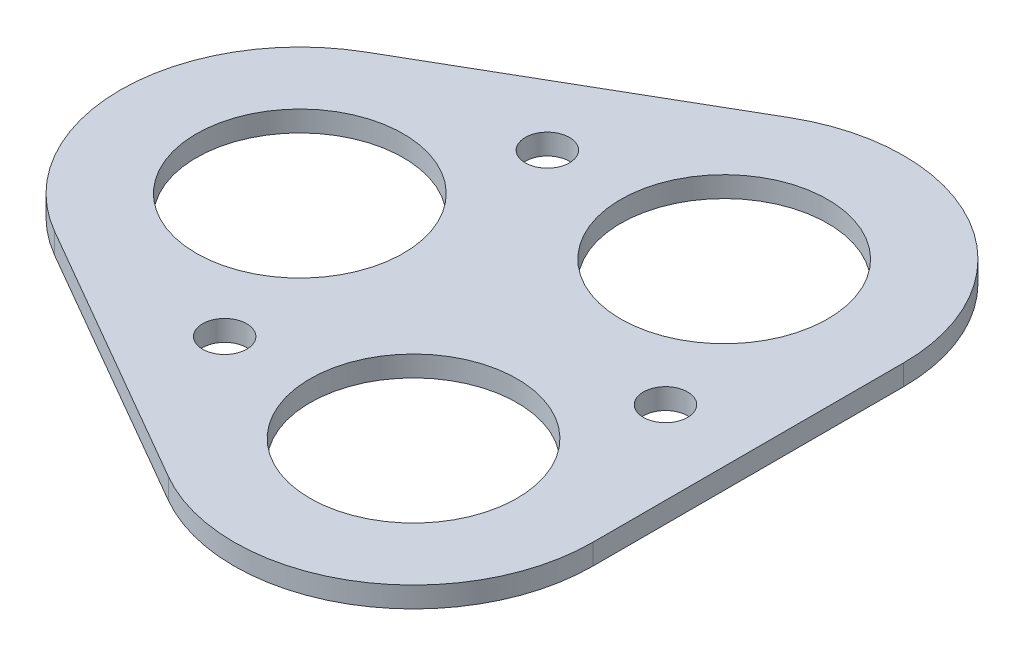
ISO-10303-21;
HEADER;
FILE_DESCRIPTION(('STEP AP214'),'2;1');
FILE_NAME('part.step','',(''),(''),'','','');
FILE_SCHEMA(('AUTOMOTIVE_DESIGN { 1 0 10303 214 1 1 1 1 }'));
ENDSEC;
DATA;
#1=APPLICATION_CONTEXT('core data for automotive mechanical design processes');
#2=APPLICATION_PROTOCOL_DEFINITION('international standard','automotive_design',2000,#1);
#3=PRODUCT_CONTEXT('',#1,'mechanical');
#4=PRODUCT('Part','Part','',(#3));
#5=PRODUCT_RELATED_PRODUCT_CATEGORY('part','',(#4));
#6=PRODUCT_DEFINITION_FORMATION('','',#4);
#7=PRODUCT_DEFINITION_CONTEXT('part definition',#1,'design');
#8=PRODUCT_DEFINITION('design','',#6,#7);
#9=PRODUCT_DEFINITION_SHAPE('','',#8);
#10=(LENGTH_UNIT() NAMED_UNIT(*) SI_UNIT(.MILLI.,.METRE.));
#11=(NAMED_UNIT(*) PLANE_ANGLE_UNIT() SI_UNIT($,.RADIAN.));
#12=(NAMED_UNIT(*) SI_UNIT($,.STERADIAN.) SOLID_ANGLE_UNIT());
#13=UNCERTAINTY_MEASURE_WITH_UNIT(LENGTH_MEASURE(1.E-05),#10,'distance_accuracy_value','');
#14=(GEOMETRIC_REPRESENTATION_CONTEXT(3) GLOBAL_UNCERTAINTY_ASSIGNED_CONTEXT((#13)) GLOBAL_UNIT_ASSIGNED_CONTEXT((#10,
#11,#12)) REPRESENTATION_CONTEXT('',''));
#15=CARTESIAN_POINT('',(0.,0.,0.));
#16=DIRECTION('',(0.,0.,1.));
#17=DIRECTION('',(1.,0.,0.));
#18=AXIS2_PLACEMENT_3D('',#15,#16,#17);
#19=CARTESIAN_POINT('',(-9.30432632419985,1.5,0.));
#20=DIRECTION('',(0.,1.,0.));
#21=DIRECTION('',(0.,0.,1.));
#22=AXIS2_PLACEMENT_3D('',#19,#20,#21);
#23=PLANE('',#22);
#24=CARTESIAN_POINT('',(17.1812452635102,1.5,0.));
#25=DIRECTION('',(0.,1.,0.));
#26=DIRECTION('',(0.,0.,1.));
#27=AXIS2_PLACEMENT_3D('',#24,#25,#26);
#28=CIRCLE('',#27,1.59999999755117);
#29=CARTESIAN_POINT('',(17.1812452635102,1.5,1.59999999755114));
#30=VERTEX_POINT('',#29);
#31=EDGE_CURVE('E204',#30,#30,#28,.T.);
#32=ORIENTED_EDGE('',*,*,#31,.F.);
#33=EDGE_LOOP('',(#32));
#34=FACE_BOUND('',#33,.T.);
#35=CARTESIAN_POINT('',(10.18124526095,1.5,11.25));
#36=DIRECTION('',(0.,1.,0.));
#37=DIRECTION('',(0.,0.,1.));
#38=AXIS2_PLACEMENT_3D('',#35,#36,#37);
#39=CIRCLE('',#38,7.50000000000001);
#40=CARTESIAN_POINT('',(10.18124526095,1.5,18.75));
#41=VERTEX_POINT('',#40);
#42=EDGE_CURVE('E216',#41,#41,#39,.T.);
#43=ORIENTED_EDGE('',*,*,#42,.F.);
#44=EDGE_LOOP('',(#43));
#45=FACE_BOUND('',#44,.T.);
#46=CARTESIAN_POINT('',(-9.30432632419985,1.5,0.));
#47=DIRECTION('',(0.,1.,0.));
#48=DIRECTION('',(0.,0.,1.));
#49=AXIS2_PLACEMENT_3D('',#46,#47,#48);
#50=CIRCLE('',#49,7.50000000000003);
#51=CARTESIAN_POINT('',(-9.30432632419985,1.5,7.50000000000009));
#52=VERTEX_POINT('',#51);
#53=EDGE_CURVE('E129',#52,#52,#50,.T.);
#54=ORIENTED_EDGE('',*,*,#53,.F.);
#55=EDGE_LOOP('',(#54));
#56=FACE_BOUND('',#55,.T.);
#57=CARTESIAN_POINT('',(-9.30432632419985,1.5,0.));
#58=DIRECTION('',(0.,1.,0.));
#59=DIRECTION('',(0.,0.,1.));
#60=AXIS2_PLACEMENT_3D('',#57,#58,#59);
#61=CIRCLE('',#60,13.);
#62=CARTESIAN_POINT('',(-15.8043263241999,1.5,-11.2583302491977));
#63=VERTEX_POINT('',#62);
#64=CARTESIAN_POINT('',(-15.8043263241998,1.5,11.2583302491978));
#65=VERTEX_POINT('',#64);
#66=EDGE_CURVE('E136',#63,#65,#61,.T.);
#67=ORIENTED_EDGE('',*,*,#66,.T.);
#68=DIRECTION('',(0.86602540378444,0.,0.499999999999997));
#69=VECTOR('',#68,1.);
#70=CARTESIAN_POINT('',(-15.8043263241998,1.5,11.2583302491978));
#71=LINE('',#70,#69);
#72=CARTESIAN_POINT('',(3.68124526095003,1.5,22.5083302491977));
#73=VERTEX_POINT('',#72);
#74=EDGE_CURVE('E94',#65,#73,#71,.T.);
#75=ORIENTED_EDGE('',*,*,#74,.T.);
#76=CARTESIAN_POINT('',(10.18124526095,1.5,11.25));
#77=DIRECTION('',(0.,1.,0.));
#78=DIRECTION('',(0.,0.,1.));
#79=AXIS2_PLACEMENT_3D('',#76,#77,#78);
#80=CIRCLE('',#79,13.);
#81=CARTESIAN_POINT('',(23.1812452609501,1.5,11.2499999999999));
#82=VERTEX_POINT('',#81);
#83=EDGE_CURVE('E107',#73,#82,#80,.T.);
#84=ORIENTED_EDGE('',*,*,#83,.T.);
#85=DIRECTION('',(0.,0.,-1.));
#86=VECTOR('',#85,1.);
#87=CARTESIAN_POINT('',(23.1812452609501,1.5,11.2499999999999));
#88=LINE('',#87,#86);
#89=CARTESIAN_POINT('',(23.18124526095,1.5,-11.25));
#90=VERTEX_POINT('',#89);
#91=EDGE_CURVE('E101',#82,#90,#88,.T.);
#92=ORIENTED_EDGE('',*,*,#91,.T.);
#93=CARTESIAN_POINT('',(10.18124526095,1.5,-11.25));
#94=DIRECTION('',(0.,1.,0.));
#95=DIRECTION('',(0.,0.,1.));
#96=AXIS2_PLACEMENT_3D('',#93,#94,#95);
#97=CIRCLE('',#96,13.);
#98=CARTESIAN_POINT('',(3.6812452609499,1.5,-22.5083302491977));
#99=VERTEX_POINT('',#98);
#100=EDGE_CURVE('E105',#90,#99,#97,.T.);
#101=ORIENTED_EDGE('',*,*,#100,.T.);
#102=DIRECTION('',(-0.866025403784437,0.,0.500000000000003));
#103=VECTOR('',#102,1.);
#104=CARTESIAN_POINT('',(3.6812452609499,1.5,-22.5083302491977));
#105=LINE('',#104,#103);
#106=EDGE_CURVE('E57',#99,#63,#105,.T.);
#107=ORIENTED_EDGE('',*,*,#106,.T.);
#108=EDGE_LOOP('',(#67,#75,#84,#92,#101,#107));
#109=FACE_BOUND('',#108,.T.);
#110=CARTESIAN_POINT('',(-3.06154026999395,1.5,-11.6871778582266));
#111=DIRECTION('',(0.,1.,0.));
#112=DIRECTION('',(0.,0.,1.));
#113=AXIS2_PLACEMENT_3D('',#110,#111,#112);
#114=CIRCLE('',#113,1.60000000000019);
#115=CARTESIAN_POINT('',(-3.06154026999395,1.5,-10.0871778582264));
#116=VERTEX_POINT('',#115);
#117=EDGE_CURVE('E222',#116,#116,#114,.T.);
#118=ORIENTED_EDGE('',*,*,#117,.F.);
#119=EDGE_LOOP('',(#118));
#120=FACE_BOUND('',#119,.T.);
#121=CARTESIAN_POINT('',(10.18124526095,1.5,-11.25));
#122=DIRECTION('',(0.,1.,0.));
#123=DIRECTION('',(0.,0.,1.));
#124=AXIS2_PLACEMENT_3D('',#121,#122,#123);
#125=CIRCLE('',#124,7.50000000000001);
#126=CARTESIAN_POINT('',(10.18124526095,1.5,-3.74999999999996));
#127=VERTEX_POINT('',#126);
#128=EDGE_CURVE('E210',#127,#127,#125,.T.);
#129=ORIENTED_EDGE('',*,*,#128,.F.);
#130=EDGE_LOOP('',(#129));
#131=FACE_BOUND('',#130,.T.);
#132=CARTESIAN_POINT('',(-3.06154026999395,1.5,11.687177373333));
#133=DIRECTION('',(0.,1.,0.));
#134=DIRECTION('',(0.,0.,1.));
#135=AXIS2_PLACEMENT_3D('',#132,#133,#134);
#136=CIRCLE('',#135,1.59999999999997);
#137=CARTESIAN_POINT('',(-3.06154026999395,1.5,13.287177373333));
#138=VERTEX_POINT('',#137);
#139=EDGE_CURVE('E195',#138,#138,#136,.T.);
#140=ORIENTED_EDGE('',*,*,#139,.F.);
#141=EDGE_LOOP('',(#140));
#142=FACE_BOUND('',#141,.T.);
#143=ADVANCED_FACE('F40',(#34,#45,#56,#109,#120,#131,#142),#23,.T.);
#144=CARTESIAN_POINT('',(-9.30432632419985,0.,0.));
#145=DIRECTION('',(0.,1.,0.));
#146=DIRECTION('',(0.,0.,1.));
#147=AXIS2_PLACEMENT_3D('',#144,#145,#146);
#148=PLANE('',#147);
#149=CARTESIAN_POINT('',(-9.30432632419985,0.,0.));
#150=DIRECTION('',(0.,1.,0.));
#151=DIRECTION('',(0.,0.,1.));
#152=AXIS2_PLACEMENT_3D('',#149,#150,#151);
#153=CIRCLE('',#152,13.);
#154=CARTESIAN_POINT('',(-15.8043263241999,0.,-11.2583302491977));
#155=VERTEX_POINT('',#154);
#156=CARTESIAN_POINT('',(-15.8043263241998,0.,11.2583302491978));
#157=VERTEX_POINT('',#156);
#158=EDGE_CURVE('E125',#155,#157,#153,.T.);
#159=ORIENTED_EDGE('',*,*,#158,.F.);
#160=DIRECTION('',(-0.866025403784437,0.,0.500000000000003));
#161=VECTOR('',#160,1.);
#162=CARTESIAN_POINT('',(3.6812452609499,0.,-22.5083302491977));
#163=LINE('',#162,#161);
#164=CARTESIAN_POINT('',(3.6812452609499,0.,-22.5083302491977));
#165=VERTEX_POINT('',#164);
#166=EDGE_CURVE('E86',#165,#155,#163,.T.);
#167=ORIENTED_EDGE('',*,*,#166,.F.);
#168=CARTESIAN_POINT('',(10.18124526095,0.,-11.25));
#169=DIRECTION('',(0.,1.,0.));
#170=DIRECTION('',(0.,0.,1.));
#171=AXIS2_PLACEMENT_3D('',#168,#169,#170);
#172=CIRCLE('',#171,13.);
#173=CARTESIAN_POINT('',(23.18124526095,0.,-11.25));
#174=VERTEX_POINT('',#173);
#175=EDGE_CURVE('E80',#174,#165,#172,.T.);
#176=ORIENTED_EDGE('',*,*,#175,.F.);
#177=DIRECTION('',(0.,0.,-1.));
#178=VECTOR('',#177,1.);
#179=CARTESIAN_POINT('',(23.1812452609501,0.,11.2499999999999));
#180=LINE('',#179,#178);
#181=CARTESIAN_POINT('',(23.1812452609501,0.,11.2499999999999));
#182=VERTEX_POINT('',#181);
#183=EDGE_CURVE('E115',#182,#174,#180,.T.);
#184=ORIENTED_EDGE('',*,*,#183,.F.);
#185=CARTESIAN_POINT('',(10.18124526095,0.,11.25));
#186=DIRECTION('',(0.,1.,0.));
#187=DIRECTION('',(0.,0.,1.));
#188=AXIS2_PLACEMENT_3D('',#185,#186,#187);
#189=CIRCLE('',#188,13.);
#190=CARTESIAN_POINT('',(3.68124526095003,0.,22.5083302491977));
#191=VERTEX_POINT('',#190);
#192=EDGE_CURVE('E131',#191,#182,#189,.T.);
#193=ORIENTED_EDGE('',*,*,#192,.F.);
#194=DIRECTION('',(0.86602540378444,0.,0.499999999999997));
#195=VECTOR('',#194,1.);
#196=CARTESIAN_POINT('',(-15.8043263241998,0.,11.2583302491978));
#197=LINE('',#196,#195);
#198=EDGE_CURVE('E128',#157,#191,#197,.T.);
#199=ORIENTED_EDGE('',*,*,#198,.F.);
#200=EDGE_LOOP('',(#159,#167,#176,#184,#193,#199));
#201=FACE_BOUND('',#200,.T.);
#202=CARTESIAN_POINT('',(-9.30432632419985,0.,0.));
#203=DIRECTION('',(0.,1.,0.));
#204=DIRECTION('',(0.,0.,1.));
#205=AXIS2_PLACEMENT_3D('',#202,#203,#204);
#206=CIRCLE('',#205,7.50000000000003);
#207=CARTESIAN_POINT('',(-9.30432632419985,0.,7.50000000000009));
#208=VERTEX_POINT('',#207);
#209=EDGE_CURVE('E225',#208,#208,#206,.T.);
#210=ORIENTED_EDGE('',*,*,#209,.T.);
#211=EDGE_LOOP('',(#210));
#212=FACE_BOUND('',#211,.T.);
#213=CARTESIAN_POINT('',(-3.06154026999395,0.,-11.6871778582266));
#214=DIRECTION('',(0.,1.,0.));
#215=DIRECTION('',(0.,0.,1.));
#216=AXIS2_PLACEMENT_3D('',#213,#214,#215);
#217=CIRCLE('',#216,1.60000000000019);
#218=CARTESIAN_POINT('',(-3.06154026999395,0.,-10.0871778582264));
#219=VERTEX_POINT('',#218);
#220=EDGE_CURVE('E219',#219,#219,#217,.T.);
#221=ORIENTED_EDGE('',*,*,#220,.T.);
#222=EDGE_LOOP('',(#221));
#223=FACE_BOUND('',#222,.T.);
#224=CARTESIAN_POINT('',(10.18124526095,0.,11.25));
#225=DIRECTION('',(0.,1.,0.));
#226=DIRECTION('',(0.,0.,1.));
#227=AXIS2_PLACEMENT_3D('',#224,#225,#226);
#228=CIRCLE('',#227,7.50000000000001);
#229=CARTESIAN_POINT('',(10.18124526095,0.,18.75));
#230=VERTEX_POINT('',#229);
#231=EDGE_CURVE('E213',#230,#230,#228,.T.);
#232=ORIENTED_EDGE('',*,*,#231,.T.);
#233=EDGE_LOOP('',(#232));
#234=FACE_BOUND('',#233,.T.);
#235=CARTESIAN_POINT('',(10.18124526095,0.,-11.25));
#236=DIRECTION('',(0.,1.,0.));
#237=DIRECTION('',(0.,0.,1.));
#238=AXIS2_PLACEMENT_3D('',#235,#236,#237);
#239=CIRCLE('',#238,7.50000000000001);
#240=CARTESIAN_POINT('',(10.18124526095,0.,-3.74999999999996));
#241=VERTEX_POINT('',#240);
#242=EDGE_CURVE('E207',#241,#241,#239,.T.);
#243=ORIENTED_EDGE('',*,*,#242,.T.);
#244=EDGE_LOOP('',(#243));
#245=FACE_BOUND('',#244,.T.);
#246=CARTESIAN_POINT('',(17.1812452635102,0.,0.));
#247=DIRECTION('',(0.,1.,0.));
#248=DIRECTION('',(0.,0.,1.));
#249=AXIS2_PLACEMENT_3D('',#246,#247,#248);
#250=CIRCLE('',#249,1.59999999755117);
#251=CARTESIAN_POINT('',(17.1812452635102,0.,1.59999999755114));
#252=VERTEX_POINT('',#251);
#253=EDGE_CURVE('E201',#252,#252,#250,.T.);
#254=ORIENTED_EDGE('',*,*,#253,.T.);
#255=EDGE_LOOP('',(#254));
#256=FACE_BOUND('',#255,.T.);
#257=CARTESIAN_POINT('',(-3.06154026999395,0.,11.687177373333));
#258=DIRECTION('',(0.,1.,0.));
#259=DIRECTION('',(0.,0.,1.));
#260=AXIS2_PLACEMENT_3D('',#257,#258,#259);
#261=CIRCLE('',#260,1.59999999999997);
#262=CARTESIAN_POINT('',(-3.06154026999395,0.,13.287177373333));
#263=VERTEX_POINT('',#262);
#264=EDGE_CURVE('E198',#263,#263,#261,.T.);
#265=ORIENTED_EDGE('',*,*,#264,.T.);
#266=EDGE_LOOP('',(#265));
#267=FACE_BOUND('',#266,.T.);
#268=ADVANCED_FACE('F145',(#201,#212,#223,#234,#245,#256,#267),#148,.F.);
#269=CARTESIAN_POINT('',(-9.30432632419985,1.5,0.));
#270=DIRECTION('',(0.,-1.,0.));
#271=DIRECTION('',(0.,0.,-1.));
#272=AXIS2_PLACEMENT_3D('',#269,#270,#271);
#273=CYLINDRICAL_SURFACE('',#272,13.);
#274=ORIENTED_EDGE('',*,*,#158,.T.);
#275=DIRECTION('',(0.,-1.,0.));
#276=VECTOR('',#275,1.);
#277=CARTESIAN_POINT('',(-15.8043263241998,1.5,11.2583302491978));
#278=LINE('',#277,#276);
#279=EDGE_CURVE('E11',#65,#157,#278,.T.);
#280=ORIENTED_EDGE('',*,*,#279,.F.);
#281=ORIENTED_EDGE('',*,*,#66,.F.);
#282=DIRECTION('',(0.,-1.,0.));
#283=VECTOR('',#282,1.);
#284=CARTESIAN_POINT('',(-15.8043263241999,1.5,-11.2583302491977));
#285=LINE('',#284,#283);
#286=EDGE_CURVE('E121',#63,#155,#285,.T.);
#287=ORIENTED_EDGE('',*,*,#286,.T.);
#288=EDGE_LOOP('',(#274,#280,#281,#287));
#289=FACE_BOUND('',#288,.T.);
#290=ADVANCED_FACE('F42',(#289),#273,.T.);
#291=CARTESIAN_POINT('',(-15.8043263241998,1.5,11.2583302491978));
#292=DIRECTION('',(0.499999999999997,0.,-0.86602540378444));
#293=DIRECTION('',(-0.86602540378444,0.,-0.499999999999997));
#294=AXIS2_PLACEMENT_3D('',#291,#292,#293);
#295=PLANE('',#294);
#296=ORIENTED_EDGE('',*,*,#198,.T.);
#297=DIRECTION('',(0.,-1.,0.));
#298=VECTOR('',#297,1.);
#299=CARTESIAN_POINT('',(3.68124526095003,1.5,22.5083302491977));
#300=LINE('',#299,#298);
#301=EDGE_CURVE('E49',#73,#191,#300,.T.);
#302=ORIENTED_EDGE('',*,*,#301,.F.);
#303=ORIENTED_EDGE('',*,*,#74,.F.);
#304=ORIENTED_EDGE('',*,*,#279,.T.);
#305=EDGE_LOOP('',(#296,#302,#303,#304));
#306=FACE_BOUND('',#305,.T.);
#307=ADVANCED_FACE('F307',(#306),#295,.F.);
#308=CARTESIAN_POINT('',(10.18124526095,1.5,11.25));
#309=DIRECTION('',(0.,-1.,0.));
#310=DIRECTION('',(0.,0.,-1.));
#311=AXIS2_PLACEMENT_3D('',#308,#309,#310);
#312=CYLINDRICAL_SURFACE('',#311,13.);
#313=ORIENTED_EDGE('',*,*,#192,.T.);
#314=DIRECTION('',(0.,-1.,0.));
#315=VECTOR('',#314,1.);
#316=CARTESIAN_POINT('',(23.1812452609501,1.5,11.2499999999999));
#317=LINE('',#316,#315);
#318=EDGE_CURVE('E116',#82,#182,#317,.T.);
#319=ORIENTED_EDGE('',*,*,#318,.F.);
#320=ORIENTED_EDGE('',*,*,#83,.F.);
#321=ORIENTED_EDGE('',*,*,#301,.T.);
#322=EDGE_LOOP('',(#313,#319,#320,#321));
#323=FACE_BOUND('',#322,.T.);
#324=ADVANCED_FACE('F142',(#323),#312,.T.);
#325=CARTESIAN_POINT('',(23.1812452609501,1.5,11.2499999999999));
#326=DIRECTION('',(-1.,0.,0.));
#327=DIRECTION('',(0.,0.,1.));
#328=AXIS2_PLACEMENT_3D('',#325,#326,#327);
#329=PLANE('',#328);
#330=ORIENTED_EDGE('',*,*,#183,.T.);
#331=DIRECTION('',(0.,-1.,0.));
#332=VECTOR('',#331,1.);
#333=CARTESIAN_POINT('',(23.18124526095,1.5,-11.25));
#334=LINE('',#333,#332);
#335=EDGE_CURVE('E112',#90,#174,#334,.T.);
#336=ORIENTED_EDGE('',*,*,#335,.F.);
#337=ORIENTED_EDGE('',*,*,#91,.F.);
#338=ORIENTED_EDGE('',*,*,#318,.T.);
#339=EDGE_LOOP('',(#330,#336,#337,#338));
#340=FACE_BOUND('',#339,.T.);
#341=ADVANCED_FACE('F113',(#340),#329,.F.);
#342=CARTESIAN_POINT('',(10.18124526095,1.5,-11.25));
#343=DIRECTION('',(0.,-1.,0.));
#344=DIRECTION('',(0.,0.,-1.));
#345=AXIS2_PLACEMENT_3D('',#342,#343,#344);
#346=CYLINDRICAL_SURFACE('',#345,13.);
#347=ORIENTED_EDGE('',*,*,#175,.T.);
#348=DIRECTION('',(0.,-1.,0.));
#349=VECTOR('',#348,1.);
#350=CARTESIAN_POINT('',(3.6812452609499,1.5,-22.5083302491977));
#351=LINE('',#350,#349);
#352=EDGE_CURVE('E117',#99,#165,#351,.T.);
#353=ORIENTED_EDGE('',*,*,#352,.F.);
#354=ORIENTED_EDGE('',*,*,#100,.F.);
#355=ORIENTED_EDGE('',*,*,#335,.T.);
#356=EDGE_LOOP('',(#347,#353,#354,#355));
#357=FACE_BOUND('',#356,.T.);
#358=ADVANCED_FACE('F119',(#357),#346,.T.);
#359=CARTESIAN_POINT('',(3.6812452609499,1.5,-22.5083302491977));
#360=DIRECTION('',(0.500000000000003,0.,0.866025403784437));
#361=DIRECTION('',(0.866025403784437,0.,-0.500000000000003));
#362=AXIS2_PLACEMENT_3D('',#359,#360,#361);
#363=PLANE('',#362);
#364=ORIENTED_EDGE('',*,*,#166,.T.);
#365=ORIENTED_EDGE('',*,*,#286,.F.);
#366=ORIENTED_EDGE('',*,*,#106,.F.);
#367=ORIENTED_EDGE('',*,*,#352,.T.);
#368=EDGE_LOOP('',(#364,#365,#366,#367));
#369=FACE_BOUND('',#368,.T.);
#370=ADVANCED_FACE('F150',(#369),#363,.F.);
#371=CARTESIAN_POINT('',(-9.30432632419985,1.5,0.));
#372=DIRECTION('',(0.,-1.,0.));
#373=DIRECTION('',(0.,0.,-1.));
#374=AXIS2_PLACEMENT_3D('',#371,#372,#373);
#375=CYLINDRICAL_SURFACE('',#374,7.50000000000003);
#376=ORIENTED_EDGE('',*,*,#53,.T.);
#377=EDGE_LOOP('',(#376));
#378=FACE_BOUND('',#377,.T.);
#379=ORIENTED_EDGE('',*,*,#209,.F.);
#380=EDGE_LOOP('',(#379));
#381=FACE_BOUND('',#380,.T.);
#382=ADVANCED_FACE('F152',(#378,#381),#375,.F.);
#383=CARTESIAN_POINT('',(-3.06154026999395,1.5,-11.6871778582266));
#384=DIRECTION('',(0.,-1.,0.));
#385=DIRECTION('',(0.,0.,-1.));
#386=AXIS2_PLACEMENT_3D('',#383,#384,#385);
#387=CYLINDRICAL_SURFACE('',#386,1.60000000000019);
#388=ORIENTED_EDGE('',*,*,#117,.T.);
#389=EDGE_LOOP('',(#388));
#390=FACE_BOUND('',#389,.T.);
#391=ORIENTED_EDGE('',*,*,#220,.F.);
#392=EDGE_LOOP('',(#391));
#393=FACE_BOUND('',#392,.T.);
#394=ADVANCED_FACE('F158',(#390,#393),#387,.F.);
#395=CARTESIAN_POINT('',(10.18124526095,1.5,11.25));
#396=DIRECTION('',(0.,-1.,0.));
#397=DIRECTION('',(0.,0.,-1.));
#398=AXIS2_PLACEMENT_3D('',#395,#396,#397);
#399=CYLINDRICAL_SURFACE('',#398,7.50000000000001);
#400=ORIENTED_EDGE('',*,*,#42,.T.);
#401=EDGE_LOOP('',(#400));
#402=FACE_BOUND('',#401,.T.);
#403=ORIENTED_EDGE('',*,*,#231,.F.);
#404=EDGE_LOOP('',(#403));
#405=FACE_BOUND('',#404,.T.);
#406=ADVANCED_FACE('F174',(#402,#405),#399,.F.);
#407=CARTESIAN_POINT('',(10.18124526095,1.5,-11.25));
#408=DIRECTION('',(0.,-1.,0.));
#409=DIRECTION('',(0.,0.,-1.));
#410=AXIS2_PLACEMENT_3D('',#407,#408,#409);
#411=CYLINDRICAL_SURFACE('',#410,7.50000000000001);
#412=ORIENTED_EDGE('',*,*,#128,.T.);
#413=EDGE_LOOP('',(#412));
#414=FACE_BOUND('',#413,.T.);
#415=ORIENTED_EDGE('',*,*,#242,.F.);
#416=EDGE_LOOP('',(#415));
#417=FACE_BOUND('',#416,.T.);
#418=ADVANCED_FACE('F178',(#414,#417),#411,.F.);
#419=CARTESIAN_POINT('',(17.1812452635102,1.5,0.));
#420=DIRECTION('',(0.,-1.,0.));
#421=DIRECTION('',(0.,0.,-1.));
#422=AXIS2_PLACEMENT_3D('',#419,#420,#421);
#423=CYLINDRICAL_SURFACE('',#422,1.59999999755117);
#424=ORIENTED_EDGE('',*,*,#31,.T.);
#425=EDGE_LOOP('',(#424));
#426=FACE_BOUND('',#425,.T.);
#427=ORIENTED_EDGE('',*,*,#253,.F.);
#428=EDGE_LOOP('',(#427));
#429=FACE_BOUND('',#428,.T.);
#430=ADVANCED_FACE('F182',(#426,#429),#423,.F.);
#431=CARTESIAN_POINT('',(-3.06154026999395,1.5,11.687177373333));
#432=DIRECTION('',(0.,-1.,0.));
#433=DIRECTION('',(0.,0.,-1.));
#434=AXIS2_PLACEMENT_3D('',#431,#432,#433);
#435=CYLINDRICAL_SURFACE('',#434,1.59999999999997);
#436=ORIENTED_EDGE('',*,*,#139,.T.);
#437=EDGE_LOOP('',(#436));
#438=FACE_BOUND('',#437,.T.);
#439=ORIENTED_EDGE('',*,*,#264,.F.);
#440=EDGE_LOOP('',(#439));
#441=FACE_BOUND('',#440,.T.);
#442=ADVANCED_FACE('F186',(#438,#441),#435,.F.);
#443=CLOSED_SHELL('',(#143,#268,#290,#307,#324,#341,#358,#370,#382,#394,#406,#418,#430,#442));
#444=MANIFOLD_SOLID_BREP('B2',#443);
#445=ADVANCED_BREP_SHAPE_REPRESENTATION('',(#18,#444),#14);
#446=SHAPE_DEFINITION_REPRESENTATION(#9,#445);
ENDSEC;
END-ISO-10303-21;
